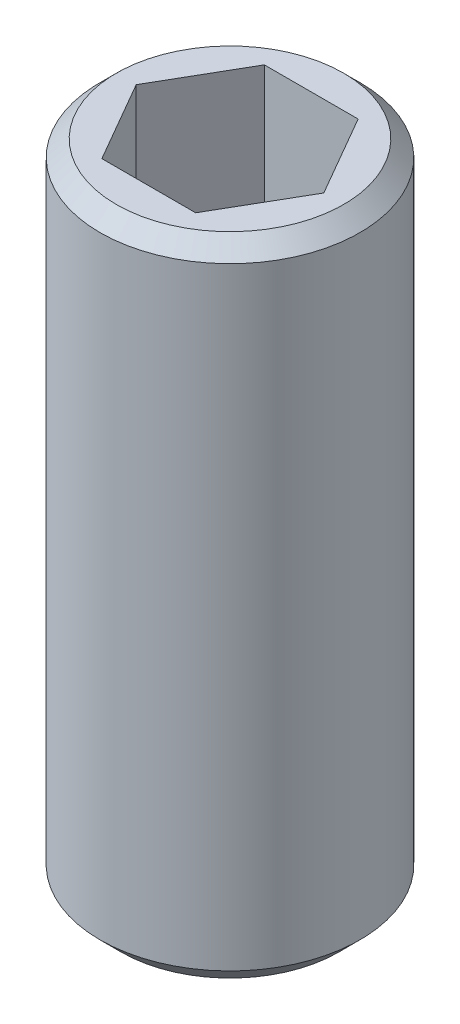
ISO-10303-21;
HEADER;
FILE_DESCRIPTION(('STEP AP214'),'2;1');
FILE_NAME('part.step','',(''),(''),'','','');
FILE_SCHEMA(('AUTOMOTIVE_DESIGN { 1 0 10303 214 1 1 1 1 }'));
ENDSEC;
DATA;
#1=APPLICATION_CONTEXT('core data for automotive mechanical design processes');
#2=APPLICATION_PROTOCOL_DEFINITION('international standard','automotive_design',2000,#1);
#3=PRODUCT_CONTEXT('',#1,'mechanical');
#4=PRODUCT('Part','Part','',(#3));
#5=PRODUCT_RELATED_PRODUCT_CATEGORY('part','',(#4));
#6=PRODUCT_DEFINITION_FORMATION('','',#4);
#7=PRODUCT_DEFINITION_CONTEXT('part definition',#1,'design');
#8=PRODUCT_DEFINITION('design','',#6,#7);
#9=PRODUCT_DEFINITION_SHAPE('','',#8);
#10=(LENGTH_UNIT() NAMED_UNIT(*) SI_UNIT(.MILLI.,.METRE.));
#11=(NAMED_UNIT(*) PLANE_ANGLE_UNIT() SI_UNIT($,.RADIAN.));
#12=(NAMED_UNIT(*) SI_UNIT($,.STERADIAN.) SOLID_ANGLE_UNIT());
#13=UNCERTAINTY_MEASURE_WITH_UNIT(LENGTH_MEASURE(1.E-05),#10,'distance_accuracy_value','');
#14=(GEOMETRIC_REPRESENTATION_CONTEXT(3) GLOBAL_UNCERTAINTY_ASSIGNED_CONTEXT((#13)) GLOBAL_UNIT_ASSIGNED_CONTEXT((#10,
#11,#12)) REPRESENTATION_CONTEXT('',''));
#15=CARTESIAN_POINT('',(0.,0.,0.));
#16=DIRECTION('',(0.,0.,1.));
#17=DIRECTION('',(1.,0.,0.));
#18=AXIS2_PLACEMENT_3D('',#15,#16,#17);
#19=CARTESIAN_POINT('',(0.,20.,0.));
#20=DIRECTION('',(0.,-1.,0.));
#21=DIRECTION('',(0.,0.,-1.));
#22=AXIS2_PLACEMENT_3D('',#19,#20,#21);
#23=CYLINDRICAL_SURFACE('',#22,4.);
#24=CARTESIAN_POINT('',(0.,0.650000000000001,0.));
#25=DIRECTION('',(0.,1.,0.));
#26=DIRECTION('',(0.,0.,1.));
#27=AXIS2_PLACEMENT_3D('',#24,#25,#26);
#28=CIRCLE('',#27,4.);
#29=CARTESIAN_POINT('',(0.,0.650000000000001,4.));
#30=VERTEX_POINT('',#29);
#31=EDGE_CURVE('E48',#30,#30,#28,.T.);
#32=ORIENTED_EDGE('',*,*,#31,.T.);
#33=EDGE_LOOP('',(#32));
#34=FACE_BOUND('',#33,.T.);
#35=CARTESIAN_POINT('',(0.,19.5,0.));
#36=DIRECTION('',(0.,1.,0.));
#37=DIRECTION('',(0.,0.,1.));
#38=AXIS2_PLACEMENT_3D('',#35,#36,#37);
#39=CIRCLE('',#38,4.);
#40=CARTESIAN_POINT('',(0.,19.5,4.));
#41=VERTEX_POINT('',#40);
#42=EDGE_CURVE('E188',#41,#41,#39,.F.);
#43=ORIENTED_EDGE('',*,*,#42,.T.);
#44=EDGE_LOOP('',(#43));
#45=FACE_BOUND('',#44,.T.);
#46=ADVANCED_FACE('F39',(#34,#45),#23,.T.);
#47=CARTESIAN_POINT('',(0.,20.,0.));
#48=DIRECTION('',(0.,1.,0.));
#49=DIRECTION('',(0.,0.,1.));
#50=AXIS2_PLACEMENT_3D('',#47,#48,#49);
#51=PLANE('',#50);
#52=CARTESIAN_POINT('',(0.,20.,0.));
#53=DIRECTION('',(0.,1.,0.));
#54=DIRECTION('',(0.,0.,1.));
#55=AXIS2_PLACEMENT_3D('',#52,#53,#54);
#56=CIRCLE('',#55,3.49999999999999);
#57=CARTESIAN_POINT('',(0.,20.,3.49999999999999));
#58=VERTEX_POINT('',#57);
#59=EDGE_CURVE('E184',#58,#58,#56,.T.);
#60=ORIENTED_EDGE('',*,*,#59,.T.);
#61=EDGE_LOOP('',(#60));
#62=FACE_BOUND('',#61,.T.);
#63=DIRECTION('',(0.5,0.,-0.866025403784439));
#64=VECTOR('',#63,1.);
#65=CARTESIAN_POINT('',(1.44337567297406,20.,2.5));
#66=LINE('',#65,#64);
#67=CARTESIAN_POINT('',(1.44337567297406,20.,2.5));
#68=VERTEX_POINT('',#67);
#69=CARTESIAN_POINT('',(2.88675134594813,20.,0.));
#70=VERTEX_POINT('',#69);
#71=EDGE_CURVE('E162',#68,#70,#66,.T.);
#72=ORIENTED_EDGE('',*,*,#71,.F.);
#73=DIRECTION('',(1.,0.,0.));
#74=VECTOR('',#73,1.);
#75=CARTESIAN_POINT('',(-1.44337567297406,20.,2.5));
#76=LINE('',#75,#74);
#77=CARTESIAN_POINT('',(-1.44337567297406,20.,2.5));
#78=VERTEX_POINT('',#77);
#79=EDGE_CURVE('E159',#78,#68,#76,.T.);
#80=ORIENTED_EDGE('',*,*,#79,.F.);
#81=DIRECTION('',(0.5,0.,0.866025403784438));
#82=VECTOR('',#81,1.);
#83=CARTESIAN_POINT('',(-2.88675134594813,20.,0.));
#84=LINE('',#83,#82);
#85=CARTESIAN_POINT('',(-2.88675134594813,20.,0.));
#86=VERTEX_POINT('',#85);
#87=EDGE_CURVE('E157',#86,#78,#84,.T.);
#88=ORIENTED_EDGE('',*,*,#87,.F.);
#89=DIRECTION('',(-0.5,0.,0.866025403784439));
#90=VECTOR('',#89,1.);
#91=CARTESIAN_POINT('',(-1.44337567297406,20.,-2.5));
#92=LINE('',#91,#90);
#93=CARTESIAN_POINT('',(-1.44337567297406,20.,-2.5));
#94=VERTEX_POINT('',#93);
#95=EDGE_CURVE('E155',#94,#86,#92,.T.);
#96=ORIENTED_EDGE('',*,*,#95,.F.);
#97=DIRECTION('',(-1.,0.,0.));
#98=VECTOR('',#97,1.);
#99=CARTESIAN_POINT('',(1.44337567297406,20.,-2.5));
#100=LINE('',#99,#98);
#101=CARTESIAN_POINT('',(1.44337567297406,20.,-2.5));
#102=VERTEX_POINT('',#101);
#103=EDGE_CURVE('E129',#102,#94,#100,.T.);
#104=ORIENTED_EDGE('',*,*,#103,.F.);
#105=DIRECTION('',(-0.5,0.,-0.866025403784438));
#106=VECTOR('',#105,1.);
#107=CARTESIAN_POINT('',(2.88675134594813,20.,0.));
#108=LINE('',#107,#106);
#109=EDGE_CURVE('E122',#70,#102,#108,.T.);
#110=ORIENTED_EDGE('',*,*,#109,.F.);
#111=EDGE_LOOP('',(#72,#80,#88,#96,#104,#110));
#112=FACE_BOUND('',#111,.T.);
#113=ADVANCED_FACE('F205',(#62,#112),#51,.T.);
#114=CARTESIAN_POINT('',(0.,0.,0.));
#115=DIRECTION('',(0.,1.,0.));
#116=DIRECTION('',(0.,0.,1.));
#117=AXIS2_PLACEMENT_3D('',#114,#115,#116);
#118=PLANE('',#117);
#119=CARTESIAN_POINT('',(0.,0.,0.));
#120=DIRECTION('',(0.,1.,0.));
#121=DIRECTION('',(0.,0.,1.));
#122=AXIS2_PLACEMENT_3D('',#119,#120,#121);
#123=CIRCLE('',#122,3.35);
#124=CARTESIAN_POINT('',(0.,0.,3.35));
#125=VERTEX_POINT('',#124);
#126=EDGE_CURVE('E11',#125,#125,#123,.F.);
#127=ORIENTED_EDGE('',*,*,#126,.T.);
#128=EDGE_LOOP('',(#127));
#129=FACE_BOUND('',#128,.T.);
#130=ADVANCED_FACE('F210',(#129),#118,.F.);
#131=CARTESIAN_POINT('',(1.44337567297406,14.,-2.5));
#132=DIRECTION('',(0.,0.,-1.));
#133=DIRECTION('',(-1.,0.,0.));
#134=AXIS2_PLACEMENT_3D('',#131,#132,#133);
#135=PLANE('',#134);
#136=ORIENTED_EDGE('',*,*,#103,.T.);
#137=DIRECTION('',(0.,1.,0.));
#138=VECTOR('',#137,1.);
#139=CARTESIAN_POINT('',(-1.44337567297406,14.,-2.5));
#140=LINE('',#139,#138);
#141=CARTESIAN_POINT('',(-1.44337567297406,14.,-2.5));
#142=VERTEX_POINT('',#141);
#143=EDGE_CURVE('E126',#142,#94,#140,.T.);
#144=ORIENTED_EDGE('',*,*,#143,.F.);
#145=DIRECTION('',(-1.,0.,0.));
#146=VECTOR('',#145,1.);
#147=CARTESIAN_POINT('',(1.44337567297406,14.,-2.5));
#148=LINE('',#147,#146);
#149=CARTESIAN_POINT('',(0.,14.,-2.5));
#150=VERTEX_POINT('',#149);
#151=EDGE_CURVE('E111',#150,#142,#148,.T.);
#152=ORIENTED_EDGE('',*,*,#151,.F.);
#153=CARTESIAN_POINT('',(1.44337567297406,14.,-2.5));
#154=VERTEX_POINT('',#153);
#155=EDGE_CURVE('E121',#154,#150,#148,.T.);
#156=ORIENTED_EDGE('',*,*,#155,.F.);
#157=DIRECTION('',(0.,1.,0.));
#158=VECTOR('',#157,1.);
#159=CARTESIAN_POINT('',(1.44337567297406,14.,-2.5));
#160=LINE('',#159,#158);
#161=EDGE_CURVE('E167',#154,#102,#160,.T.);
#162=ORIENTED_EDGE('',*,*,#161,.T.);
#163=EDGE_LOOP('',(#136,#144,#152,#156,#162));
#164=FACE_BOUND('',#163,.T.);
#165=ADVANCED_FACE('F127',(#164),#135,.F.);
#166=CARTESIAN_POINT('',(2.88675134594813,14.,0.));
#167=DIRECTION('',(0.866025403784438,0.,-0.5));
#168=DIRECTION('',(-0.5,0.,-0.866025403784439));
#169=AXIS2_PLACEMENT_3D('',#166,#167,#168);
#170=PLANE('',#169);
#171=ORIENTED_EDGE('',*,*,#109,.T.);
#172=ORIENTED_EDGE('',*,*,#161,.F.);
#173=DIRECTION('',(-0.5,0.,-0.866025403784438));
#174=VECTOR('',#173,1.);
#175=CARTESIAN_POINT('',(2.88675134594813,14.,0.));
#176=LINE('',#175,#174);
#177=CARTESIAN_POINT('',(2.1650635094611,14.,-1.25));
#178=VERTEX_POINT('',#177);
#179=EDGE_CURVE('E151',#178,#154,#176,.T.);
#180=ORIENTED_EDGE('',*,*,#179,.F.);
#181=CARTESIAN_POINT('',(2.88675134594813,14.,0.));
#182=VERTEX_POINT('',#181);
#183=EDGE_CURVE('E133',#182,#178,#176,.T.);
#184=ORIENTED_EDGE('',*,*,#183,.F.);
#185=DIRECTION('',(0.,1.,0.));
#186=VECTOR('',#185,1.);
#187=CARTESIAN_POINT('',(2.88675134594813,14.,0.));
#188=LINE('',#187,#186);
#189=EDGE_CURVE('E170',#182,#70,#188,.T.);
#190=ORIENTED_EDGE('',*,*,#189,.T.);
#191=EDGE_LOOP('',(#171,#172,#180,#184,#190));
#192=FACE_BOUND('',#191,.T.);
#193=ADVANCED_FACE('F227',(#192),#170,.F.);
#194=CARTESIAN_POINT('',(1.44337567297406,14.,2.5));
#195=DIRECTION('',(0.866025403784438,0.,0.5));
#196=DIRECTION('',(0.5,0.,-0.866025403784439));
#197=AXIS2_PLACEMENT_3D('',#194,#195,#196);
#198=PLANE('',#197);
#199=ORIENTED_EDGE('',*,*,#71,.T.);
#200=ORIENTED_EDGE('',*,*,#189,.F.);
#201=DIRECTION('',(0.5,0.,-0.866025403784439));
#202=VECTOR('',#201,1.);
#203=CARTESIAN_POINT('',(1.44337567297406,14.,2.5));
#204=LINE('',#203,#202);
#205=CARTESIAN_POINT('',(2.16506350946109,14.,1.24999999999999));
#206=VERTEX_POINT('',#205);
#207=EDGE_CURVE('E149',#206,#182,#204,.T.);
#208=ORIENTED_EDGE('',*,*,#207,.F.);
#209=CARTESIAN_POINT('',(1.44337567297406,14.,2.5));
#210=VERTEX_POINT('',#209);
#211=EDGE_CURVE('E55',#210,#206,#204,.T.);
#212=ORIENTED_EDGE('',*,*,#211,.F.);
#213=DIRECTION('',(0.,1.,0.));
#214=VECTOR('',#213,1.);
#215=CARTESIAN_POINT('',(1.44337567297406,14.,2.5));
#216=LINE('',#215,#214);
#217=EDGE_CURVE('E173',#210,#68,#216,.T.);
#218=ORIENTED_EDGE('',*,*,#217,.T.);
#219=EDGE_LOOP('',(#199,#200,#208,#212,#218));
#220=FACE_BOUND('',#219,.T.);
#221=ADVANCED_FACE('F238',(#220),#198,.F.);
#222=CARTESIAN_POINT('',(-1.44337567297406,14.,2.5));
#223=DIRECTION('',(0.,0.,1.));
#224=DIRECTION('',(1.,0.,0.));
#225=AXIS2_PLACEMENT_3D('',#222,#223,#224);
#226=PLANE('',#225);
#227=ORIENTED_EDGE('',*,*,#79,.T.);
#228=ORIENTED_EDGE('',*,*,#217,.F.);
#229=DIRECTION('',(1.,0.,0.));
#230=VECTOR('',#229,1.);
#231=CARTESIAN_POINT('',(-1.44337567297406,14.,2.5));
#232=LINE('',#231,#230);
#233=CARTESIAN_POINT('',(0.,14.,2.5));
#234=VERTEX_POINT('',#233);
#235=EDGE_CURVE('E145',#234,#210,#232,.T.);
#236=ORIENTED_EDGE('',*,*,#235,.F.);
#237=CARTESIAN_POINT('',(-1.44337567297406,14.,2.5));
#238=VERTEX_POINT('',#237);
#239=EDGE_CURVE('E146',#238,#234,#232,.T.);
#240=ORIENTED_EDGE('',*,*,#239,.F.);
#241=DIRECTION('',(0.,1.,0.));
#242=VECTOR('',#241,1.);
#243=CARTESIAN_POINT('',(-1.44337567297406,14.,2.5));
#244=LINE('',#243,#242);
#245=EDGE_CURVE('E176',#238,#78,#244,.T.);
#246=ORIENTED_EDGE('',*,*,#245,.T.);
#247=EDGE_LOOP('',(#227,#228,#236,#240,#246));
#248=FACE_BOUND('',#247,.T.);
#249=ADVANCED_FACE('F234',(#248),#226,.F.);
#250=CARTESIAN_POINT('',(-2.88675134594813,14.,0.));
#251=DIRECTION('',(-0.866025403784438,0.,0.5));
#252=DIRECTION('',(0.5,0.,0.866025403784439));
#253=AXIS2_PLACEMENT_3D('',#250,#251,#252);
#254=PLANE('',#253);
#255=ORIENTED_EDGE('',*,*,#87,.T.);
#256=ORIENTED_EDGE('',*,*,#245,.F.);
#257=DIRECTION('',(0.5,0.,0.866025403784438));
#258=VECTOR('',#257,1.);
#259=CARTESIAN_POINT('',(-2.88675134594813,14.,0.));
#260=LINE('',#259,#258);
#261=CARTESIAN_POINT('',(-2.1650635094611,14.,1.25));
#262=VERTEX_POINT('',#261);
#263=EDGE_CURVE('E139',#262,#238,#260,.T.);
#264=ORIENTED_EDGE('',*,*,#263,.F.);
#265=CARTESIAN_POINT('',(-2.88675134594813,14.,0.));
#266=VERTEX_POINT('',#265);
#267=EDGE_CURVE('E141',#266,#262,#260,.T.);
#268=ORIENTED_EDGE('',*,*,#267,.F.);
#269=DIRECTION('',(0.,1.,0.));
#270=VECTOR('',#269,1.);
#271=CARTESIAN_POINT('',(-2.88675134594813,14.,0.));
#272=LINE('',#271,#270);
#273=EDGE_CURVE('E132',#266,#86,#272,.T.);
#274=ORIENTED_EDGE('',*,*,#273,.T.);
#275=EDGE_LOOP('',(#255,#256,#264,#268,#274));
#276=FACE_BOUND('',#275,.T.);
#277=ADVANCED_FACE('F231',(#276),#254,.F.);
#278=CARTESIAN_POINT('',(-1.44337567297406,14.,-2.5));
#279=DIRECTION('',(-0.866025403784439,0.,-0.5));
#280=DIRECTION('',(-0.5,0.,0.866025403784439));
#281=AXIS2_PLACEMENT_3D('',#278,#279,#280);
#282=PLANE('',#281);
#283=ORIENTED_EDGE('',*,*,#95,.T.);
#284=ORIENTED_EDGE('',*,*,#273,.F.);
#285=DIRECTION('',(-0.5,0.,0.866025403784439));
#286=VECTOR('',#285,1.);
#287=CARTESIAN_POINT('',(-1.44337567297406,14.,-2.5));
#288=LINE('',#287,#286);
#289=CARTESIAN_POINT('',(-2.1650635094611,14.,-1.25));
#290=VERTEX_POINT('',#289);
#291=EDGE_CURVE('E138',#290,#266,#288,.T.);
#292=ORIENTED_EDGE('',*,*,#291,.F.);
#293=EDGE_CURVE('E115',#142,#290,#288,.T.);
#294=ORIENTED_EDGE('',*,*,#293,.F.);
#295=ORIENTED_EDGE('',*,*,#143,.T.);
#296=EDGE_LOOP('',(#283,#284,#292,#294,#295));
#297=FACE_BOUND('',#296,.T.);
#298=ADVANCED_FACE('F136',(#297),#282,.F.);
#299=CARTESIAN_POINT('',(0.,14.,0.));
#300=DIRECTION('',(0.,1.,0.));
#301=DIRECTION('',(0.,0.,1.));
#302=AXIS2_PLACEMENT_3D('',#299,#300,#301);
#303=PLANE('',#302);
#304=CARTESIAN_POINT('',(0.,14.,0.));
#305=DIRECTION('',(0.,1.,0.));
#306=DIRECTION('',(0.,0.,1.));
#307=AXIS2_PLACEMENT_3D('',#304,#305,#306);
#308=CIRCLE('',#307,2.49999999999999);
#309=EDGE_CURVE('E169',#262,#234,#308,.T.);
#310=ORIENTED_EDGE('',*,*,#309,.F.);
#311=ORIENTED_EDGE('',*,*,#263,.T.);
#312=ORIENTED_EDGE('',*,*,#239,.T.);
#313=EDGE_LOOP('',(#310,#311,#312));
#314=FACE_BOUND('',#313,.T.);
#315=ADVANCED_FACE('F230',(#314),#303,.T.);
#316=EDGE_CURVE('E269',#290,#262,#308,.T.);
#317=ORIENTED_EDGE('',*,*,#316,.F.);
#318=ORIENTED_EDGE('',*,*,#291,.T.);
#319=ORIENTED_EDGE('',*,*,#267,.T.);
#320=EDGE_LOOP('',(#317,#318,#319));
#321=FACE_BOUND('',#320,.T.);
#322=ADVANCED_FACE('F247',(#321),#303,.T.);
#323=EDGE_CURVE('E117',#150,#290,#308,.T.);
#324=ORIENTED_EDGE('',*,*,#323,.F.);
#325=ORIENTED_EDGE('',*,*,#151,.T.);
#326=ORIENTED_EDGE('',*,*,#293,.T.);
#327=EDGE_LOOP('',(#324,#325,#326));
#328=FACE_BOUND('',#327,.T.);
#329=ADVANCED_FACE('F113',(#328),#303,.T.);
#330=EDGE_CURVE('E270',#178,#150,#308,.T.);
#331=ORIENTED_EDGE('',*,*,#330,.F.);
#332=ORIENTED_EDGE('',*,*,#179,.T.);
#333=ORIENTED_EDGE('',*,*,#155,.T.);
#334=EDGE_LOOP('',(#331,#332,#333));
#335=FACE_BOUND('',#334,.T.);
#336=ADVANCED_FACE('F258',(#335),#303,.T.);
#337=EDGE_CURVE('E185',#206,#178,#308,.T.);
#338=ORIENTED_EDGE('',*,*,#337,.F.);
#339=ORIENTED_EDGE('',*,*,#207,.T.);
#340=ORIENTED_EDGE('',*,*,#183,.T.);
#341=EDGE_LOOP('',(#338,#339,#340));
#342=FACE_BOUND('',#341,.T.);
#343=ADVANCED_FACE('F254',(#342),#303,.T.);
#344=EDGE_CURVE('E181',#234,#206,#308,.T.);
#345=ORIENTED_EDGE('',*,*,#344,.F.);
#346=ORIENTED_EDGE('',*,*,#235,.T.);
#347=ORIENTED_EDGE('',*,*,#211,.T.);
#348=EDGE_LOOP('',(#345,#346,#347));
#349=FACE_BOUND('',#348,.T.);
#350=ADVANCED_FACE('F224',(#349),#303,.T.);
#351=CARTESIAN_POINT('',(0.,14.,0.));
#352=DIRECTION('',(0.,1.,0.));
#353=DIRECTION('',(0.,0.,1.));
#354=AXIS2_PLACEMENT_3D('',#351,#352,#353);
#355=CONICAL_SURFACE('',#354,2.49999999999999,1.02974425867665);
#356=CARTESIAN_POINT('',(0.,12.4978484524311,0.));
#357=VERTEX_POINT('',#356);
#358=VERTEX_LOOP('',#357);
#359=FACE_BOUND('',#358,.T.);
#360=ORIENTED_EDGE('',*,*,#344,.T.);
#361=ORIENTED_EDGE('',*,*,#337,.T.);
#362=ORIENTED_EDGE('',*,*,#330,.T.);
#363=ORIENTED_EDGE('',*,*,#323,.T.);
#364=ORIENTED_EDGE('',*,*,#316,.T.);
#365=ORIENTED_EDGE('',*,*,#309,.T.);
#366=EDGE_LOOP('',(#360,#361,#362,#363,#364,#365));
#367=FACE_BOUND('',#366,.T.);
#368=ADVANCED_FACE('F201',(#359,#367),#355,.F.);
#369=CARTESIAN_POINT('',(0.,20.,0.));
#370=DIRECTION('',(0.,-1.,0.));
#371=DIRECTION('',(0.,0.,-1.));
#372=AXIS2_PLACEMENT_3D('',#369,#370,#371);
#373=CONICAL_SURFACE('',#372,3.49999999999999,0.785398163397447);
#374=ORIENTED_EDGE('',*,*,#42,.F.);
#375=EDGE_LOOP('',(#374));
#376=FACE_BOUND('',#375,.T.);
#377=ORIENTED_EDGE('',*,*,#59,.F.);
#378=EDGE_LOOP('',(#377));
#379=FACE_BOUND('',#378,.T.);
#380=ADVANCED_FACE('F196',(#376,#379),#373,.T.);
#381=CARTESIAN_POINT('',(0.,0.650000000000001,0.));
#382=DIRECTION('',(0.,1.,0.));
#383=DIRECTION('',(0.,0.,1.));
#384=AXIS2_PLACEMENT_3D('',#381,#382,#383);
#385=CONICAL_SURFACE('',#384,4.,0.785398163397449);
#386=ORIENTED_EDGE('',*,*,#126,.F.);
#387=EDGE_LOOP('',(#386));
#388=FACE_BOUND('',#387,.T.);
#389=ORIENTED_EDGE('',*,*,#31,.F.);
#390=EDGE_LOOP('',(#389));
#391=FACE_BOUND('',#390,.T.);
#392=ADVANCED_FACE('F42',(#388,#391),#385,.T.);
#393=CLOSED_SHELL('',(#46,#113,#130,#165,#193,#221,#249,#277,#298,#315,#322,#329,#336,#343,#350,
#368,#380,#392));
#394=MANIFOLD_SOLID_BREP('B2',#393);
#395=ADVANCED_BREP_SHAPE_REPRESENTATION('',(#18,#394),#14);
#396=SHAPE_DEFINITION_REPRESENTATION(#9,#395);
ENDSEC;
END-ISO-10303-21;
